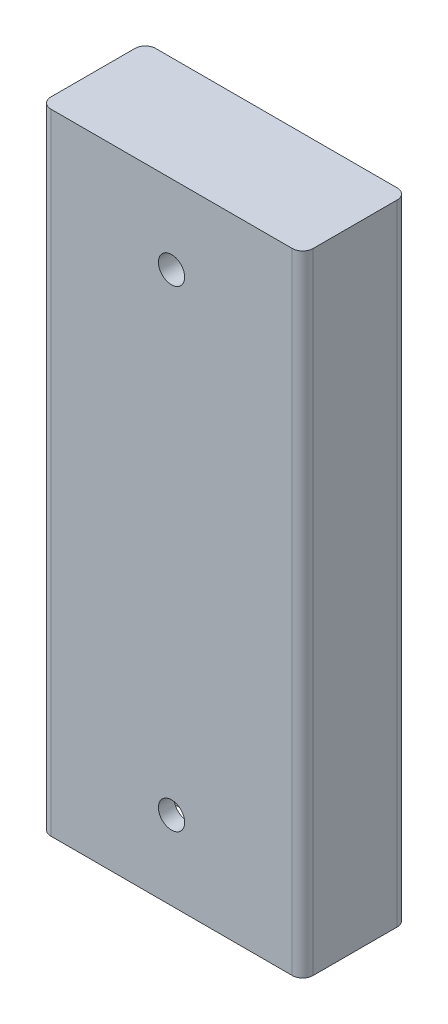
ISO-10303-21;
HEADER;
FILE_DESCRIPTION(('STEP AP214'),'2;1');
FILE_NAME('part.step','',(''),(''),'','','');
FILE_SCHEMA(('AUTOMOTIVE_DESIGN { 1 0 10303 214 1 1 1 1 }'));
ENDSEC;
DATA;
#1=APPLICATION_CONTEXT('core data for automotive mechanical design processes');
#2=APPLICATION_PROTOCOL_DEFINITION('international standard','automotive_design',2000,#1);
#3=PRODUCT_CONTEXT('',#1,'mechanical');
#4=PRODUCT('Part','Part','',(#3));
#5=PRODUCT_RELATED_PRODUCT_CATEGORY('part','',(#4));
#6=PRODUCT_DEFINITION_FORMATION('','',#4);
#7=PRODUCT_DEFINITION_CONTEXT('part definition',#1,'design');
#8=PRODUCT_DEFINITION('design','',#6,#7);
#9=PRODUCT_DEFINITION_SHAPE('','',#8);
#10=(LENGTH_UNIT() NAMED_UNIT(*) SI_UNIT(.MILLI.,.METRE.));
#11=(NAMED_UNIT(*) PLANE_ANGLE_UNIT() SI_UNIT($,.RADIAN.));
#12=(NAMED_UNIT(*) SI_UNIT($,.STERADIAN.) SOLID_ANGLE_UNIT());
#13=UNCERTAINTY_MEASURE_WITH_UNIT(LENGTH_MEASURE(1.E-05),#10,'distance_accuracy_value','');
#14=(GEOMETRIC_REPRESENTATION_CONTEXT(3) GLOBAL_UNCERTAINTY_ASSIGNED_CONTEXT((#13)) GLOBAL_UNIT_ASSIGNED_CONTEXT((#10,
#11,#12)) REPRESENTATION_CONTEXT('',''));
#15=CARTESIAN_POINT('',(0.,0.,0.));
#16=DIRECTION('',(0.,0.,1.));
#17=DIRECTION('',(1.,0.,0.));
#18=AXIS2_PLACEMENT_3D('',#15,#16,#17);
#19=CARTESIAN_POINT('',(2.,120.,-2.));
#20=DIRECTION('',(0.,-1.,0.));
#21=DIRECTION('',(0.,0.,-1.));
#22=AXIS2_PLACEMENT_3D('',#19,#20,#21);
#23=CYLINDRICAL_SURFACE('',#22,2.);
#24=CARTESIAN_POINT('',(2.,0.,-2.));
#25=DIRECTION('',(0.,1.,0.));
#26=DIRECTION('',(0.,0.,-1.));
#27=AXIS2_PLACEMENT_3D('',#24,#25,#26);
#28=CIRCLE('',#27,2.);
#29=CARTESIAN_POINT('',(0.,0.,-2.));
#30=VERTEX_POINT('',#29);
#31=CARTESIAN_POINT('',(2.,0.,0.));
#32=VERTEX_POINT('',#31);
#33=EDGE_CURVE('E158',#30,#32,#28,.T.);
#34=ORIENTED_EDGE('',*,*,#33,.T.);
#35=DIRECTION('',(0.,-1.,0.));
#36=VECTOR('',#35,1.);
#37=CARTESIAN_POINT('',(2.,120.,0.));
#38=LINE('',#37,#36);
#39=CARTESIAN_POINT('',(2.,120.,0.));
#40=VERTEX_POINT('',#39);
#41=EDGE_CURVE('E11',#40,#32,#38,.T.);
#42=ORIENTED_EDGE('',*,*,#41,.F.);
#43=CARTESIAN_POINT('',(2.,120.,-2.));
#44=DIRECTION('',(0.,1.,0.));
#45=DIRECTION('',(0.,0.,-1.));
#46=AXIS2_PLACEMENT_3D('',#43,#44,#45);
#47=CIRCLE('',#46,2.);
#48=CARTESIAN_POINT('',(0.,120.,-2.));
#49=VERTEX_POINT('',#48);
#50=EDGE_CURVE('E182',#49,#40,#47,.T.);
#51=ORIENTED_EDGE('',*,*,#50,.F.);
#52=DIRECTION('',(0.,-1.,0.));
#53=VECTOR('',#52,1.);
#54=CARTESIAN_POINT('',(0.,120.,-2.));
#55=LINE('',#54,#53);
#56=EDGE_CURVE('E154',#49,#30,#55,.T.);
#57=ORIENTED_EDGE('',*,*,#56,.T.);
#58=EDGE_LOOP('',(#34,#42,#51,#57));
#59=FACE_BOUND('',#58,.T.);
#60=ADVANCED_FACE('F43',(#59),#23,.T.);
#61=CARTESIAN_POINT('',(2.,120.,0.));
#62=DIRECTION('',(0.,0.,-1.));
#63=DIRECTION('',(-1.,0.,0.));
#64=AXIS2_PLACEMENT_3D('',#61,#62,#63);
#65=PLANE('',#64);
#66=CARTESIAN_POINT('',(25.,105.,0.));
#67=DIRECTION('',(0.,0.,1.));
#68=DIRECTION('',(1.,0.,0.));
#69=AXIS2_PLACEMENT_3D('',#66,#67,#68);
#70=CIRCLE('',#69,2.5);
#71=CARTESIAN_POINT('',(27.5,105.,0.));
#72=VERTEX_POINT('',#71);
#73=EDGE_CURVE('E203',#72,#72,#70,.T.);
#74=ORIENTED_EDGE('',*,*,#73,.F.);
#75=EDGE_LOOP('',(#74));
#76=FACE_BOUND('',#75,.T.);
#77=CARTESIAN_POINT('',(25.,15.,0.));
#78=DIRECTION('',(0.,0.,1.));
#79=DIRECTION('',(1.,0.,0.));
#80=AXIS2_PLACEMENT_3D('',#77,#78,#79);
#81=CIRCLE('',#80,2.5);
#82=CARTESIAN_POINT('',(27.5,15.,0.));
#83=VERTEX_POINT('',#82);
#84=EDGE_CURVE('E212',#83,#83,#81,.T.);
#85=ORIENTED_EDGE('',*,*,#84,.F.);
#86=EDGE_LOOP('',(#85));
#87=FACE_BOUND('',#86,.T.);
#88=DIRECTION('',(1.,0.,0.));
#89=VECTOR('',#88,1.);
#90=CARTESIAN_POINT('',(2.,0.,0.));
#91=LINE('',#90,#89);
#92=CARTESIAN_POINT('',(48.,0.,0.));
#93=VERTEX_POINT('',#92);
#94=EDGE_CURVE('E162',#32,#93,#91,.T.);
#95=ORIENTED_EDGE('',*,*,#94,.T.);
#96=DIRECTION('',(0.,-1.,0.));
#97=VECTOR('',#96,1.);
#98=CARTESIAN_POINT('',(48.,120.,0.));
#99=LINE('',#98,#97);
#100=CARTESIAN_POINT('',(48.,120.,0.));
#101=VERTEX_POINT('',#100);
#102=EDGE_CURVE('E52',#101,#93,#99,.T.);
#103=ORIENTED_EDGE('',*,*,#102,.F.);
#104=DIRECTION('',(1.,0.,0.));
#105=VECTOR('',#104,1.);
#106=CARTESIAN_POINT('',(2.,120.,0.));
#107=LINE('',#106,#105);
#108=EDGE_CURVE('E110',#40,#101,#107,.T.);
#109=ORIENTED_EDGE('',*,*,#108,.F.);
#110=ORIENTED_EDGE('',*,*,#41,.T.);
#111=EDGE_LOOP('',(#95,#103,#109,#110));
#112=FACE_BOUND('',#111,.T.);
#113=ADVANCED_FACE('F293',(#76,#87,#112),#65,.F.);
#114=CARTESIAN_POINT('',(48.,120.,-2.));
#115=DIRECTION('',(0.,-1.,0.));
#116=DIRECTION('',(0.,0.,-1.));
#117=AXIS2_PLACEMENT_3D('',#114,#115,#116);
#118=CYLINDRICAL_SURFACE('',#117,2.);
#119=CARTESIAN_POINT('',(48.,0.,-2.));
#120=DIRECTION('',(0.,1.,0.));
#121=DIRECTION('',(0.,0.,1.));
#122=AXIS2_PLACEMENT_3D('',#119,#120,#121);
#123=CIRCLE('',#122,2.);
#124=CARTESIAN_POINT('',(50.,0.,-2.));
#125=VERTEX_POINT('',#124);
#126=EDGE_CURVE('E166',#93,#125,#123,.T.);
#127=ORIENTED_EDGE('',*,*,#126,.T.);
#128=DIRECTION('',(0.,-1.,0.));
#129=VECTOR('',#128,1.);
#130=CARTESIAN_POINT('',(50.,120.,-2.));
#131=LINE('',#130,#129);
#132=CARTESIAN_POINT('',(50.,120.,-2.));
#133=VERTEX_POINT('',#132);
#134=EDGE_CURVE('E193',#133,#125,#131,.T.);
#135=ORIENTED_EDGE('',*,*,#134,.F.);
#136=CARTESIAN_POINT('',(48.,120.,-2.));
#137=DIRECTION('',(0.,1.,0.));
#138=DIRECTION('',(0.,0.,1.));
#139=AXIS2_PLACEMENT_3D('',#136,#137,#138);
#140=CIRCLE('',#139,2.);
#141=EDGE_CURVE('E270',#101,#133,#140,.T.);
#142=ORIENTED_EDGE('',*,*,#141,.F.);
#143=ORIENTED_EDGE('',*,*,#102,.T.);
#144=EDGE_LOOP('',(#127,#135,#142,#143));
#145=FACE_BOUND('',#144,.T.);
#146=ADVANCED_FACE('F298',(#145),#118,.T.);
#147=CARTESIAN_POINT('',(50.,120.,-2.));
#148=DIRECTION('',(-1.,0.,0.));
#149=DIRECTION('',(0.,0.,1.));
#150=AXIS2_PLACEMENT_3D('',#147,#148,#149);
#151=PLANE('',#150);
#152=DIRECTION('',(0.,0.,-1.));
#153=VECTOR('',#152,1.);
#154=CARTESIAN_POINT('',(50.,0.,-2.));
#155=LINE('',#154,#153);
#156=CARTESIAN_POINT('',(50.,0.,-18.));
#157=VERTEX_POINT('',#156);
#158=EDGE_CURVE('E169',#125,#157,#155,.T.);
#159=ORIENTED_EDGE('',*,*,#158,.T.);
#160=DIRECTION('',(0.,-1.,0.));
#161=VECTOR('',#160,1.);
#162=CARTESIAN_POINT('',(50.,120.,-18.));
#163=LINE('',#162,#161);
#164=CARTESIAN_POINT('',(50.,120.,-18.));
#165=VERTEX_POINT('',#164);
#166=EDGE_CURVE('E189',#165,#157,#163,.T.);
#167=ORIENTED_EDGE('',*,*,#166,.F.);
#168=DIRECTION('',(0.,0.,-1.));
#169=VECTOR('',#168,1.);
#170=CARTESIAN_POINT('',(50.,120.,-2.));
#171=LINE('',#170,#169);
#172=EDGE_CURVE('E273',#133,#165,#171,.T.);
#173=ORIENTED_EDGE('',*,*,#172,.F.);
#174=ORIENTED_EDGE('',*,*,#134,.T.);
#175=EDGE_LOOP('',(#159,#167,#173,#174));
#176=FACE_BOUND('',#175,.T.);
#177=ADVANCED_FACE('F313',(#176),#151,.F.);
#178=CARTESIAN_POINT('',(48.,120.,-18.));
#179=DIRECTION('',(0.,-1.,0.));
#180=DIRECTION('',(0.,0.,-1.));
#181=AXIS2_PLACEMENT_3D('',#178,#179,#180);
#182=CYLINDRICAL_SURFACE('',#181,2.);
#183=CARTESIAN_POINT('',(48.,0.,-18.));
#184=DIRECTION('',(0.,1.,0.));
#185=DIRECTION('',(0.,0.,-1.));
#186=AXIS2_PLACEMENT_3D('',#183,#184,#185);
#187=CIRCLE('',#186,2.);
#188=CARTESIAN_POINT('',(48.,0.,-20.));
#189=VERTEX_POINT('',#188);
#190=EDGE_CURVE('E172',#157,#189,#187,.T.);
#191=ORIENTED_EDGE('',*,*,#190,.T.);
#192=DIRECTION('',(0.,-1.,0.));
#193=VECTOR('',#192,1.);
#194=CARTESIAN_POINT('',(48.,120.,-20.));
#195=LINE('',#194,#193);
#196=CARTESIAN_POINT('',(48.,120.,-20.));
#197=VERTEX_POINT('',#196);
#198=EDGE_CURVE('E147',#197,#189,#195,.T.);
#199=ORIENTED_EDGE('',*,*,#198,.F.);
#200=CARTESIAN_POINT('',(48.,120.,-18.));
#201=DIRECTION('',(0.,1.,0.));
#202=DIRECTION('',(0.,0.,-1.));
#203=AXIS2_PLACEMENT_3D('',#200,#201,#202);
#204=CIRCLE('',#203,2.);
#205=EDGE_CURVE('E133',#165,#197,#204,.T.);
#206=ORIENTED_EDGE('',*,*,#205,.F.);
#207=ORIENTED_EDGE('',*,*,#166,.T.);
#208=EDGE_LOOP('',(#191,#199,#206,#207));
#209=FACE_BOUND('',#208,.T.);
#210=ADVANCED_FACE('F316',(#209),#182,.T.);
#211=CARTESIAN_POINT('',(2.,120.,-20.));
#212=DIRECTION('',(0.,0.,1.));
#213=DIRECTION('',(1.,0.,0.));
#214=AXIS2_PLACEMENT_3D('',#211,#212,#213);
#215=PLANE('',#214);
#216=CARTESIAN_POINT('',(25.,105.,-20.));
#217=DIRECTION('',(0.,0.,1.));
#218=DIRECTION('',(1.,0.,0.));
#219=AXIS2_PLACEMENT_3D('',#216,#217,#218);
#220=CIRCLE('',#219,2.5);
#221=CARTESIAN_POINT('',(27.5,105.,-20.));
#222=VERTEX_POINT('',#221);
#223=EDGE_CURVE('E46',#222,#222,#220,.T.);
#224=ORIENTED_EDGE('',*,*,#223,.T.);
#225=EDGE_LOOP('',(#224));
#226=FACE_BOUND('',#225,.T.);
#227=CARTESIAN_POINT('',(25.,15.,-20.));
#228=DIRECTION('',(0.,0.,1.));
#229=DIRECTION('',(1.,0.,0.));
#230=AXIS2_PLACEMENT_3D('',#227,#228,#229);
#231=CIRCLE('',#230,2.5);
#232=CARTESIAN_POINT('',(27.5,15.,-20.));
#233=VERTEX_POINT('',#232);
#234=EDGE_CURVE('E209',#233,#233,#231,.T.);
#235=ORIENTED_EDGE('',*,*,#234,.T.);
#236=EDGE_LOOP('',(#235));
#237=FACE_BOUND('',#236,.T.);
#238=DIRECTION('',(-1.,0.,0.));
#239=VECTOR('',#238,1.);
#240=CARTESIAN_POINT('',(2.,0.,-20.));
#241=LINE('',#240,#239);
#242=CARTESIAN_POINT('',(2.,0.,-20.));
#243=VERTEX_POINT('',#242);
#244=EDGE_CURVE('E143',#189,#243,#241,.T.);
#245=ORIENTED_EDGE('',*,*,#244,.T.);
#246=DIRECTION('',(0.,-1.,0.));
#247=VECTOR('',#246,1.);
#248=CARTESIAN_POINT('',(2.,120.,-20.));
#249=LINE('',#248,#247);
#250=CARTESIAN_POINT('',(2.,120.,-20.));
#251=VERTEX_POINT('',#250);
#252=EDGE_CURVE('E140',#251,#243,#249,.T.);
#253=ORIENTED_EDGE('',*,*,#252,.F.);
#254=DIRECTION('',(-1.,0.,0.));
#255=VECTOR('',#254,1.);
#256=CARTESIAN_POINT('',(2.,120.,-20.));
#257=LINE('',#256,#255);
#258=EDGE_CURVE('E126',#197,#251,#257,.T.);
#259=ORIENTED_EDGE('',*,*,#258,.F.);
#260=ORIENTED_EDGE('',*,*,#198,.T.);
#261=EDGE_LOOP('',(#245,#253,#259,#260));
#262=FACE_BOUND('',#261,.T.);
#263=ADVANCED_FACE('F141',(#226,#237,#262),#215,.F.);
#264=CARTESIAN_POINT('',(2.,120.,-18.));
#265=DIRECTION('',(0.,-1.,0.));
#266=DIRECTION('',(0.,0.,-1.));
#267=AXIS2_PLACEMENT_3D('',#264,#265,#266);
#268=CYLINDRICAL_SURFACE('',#267,2.);
#269=CARTESIAN_POINT('',(2.,0.,-18.));
#270=DIRECTION('',(0.,1.,0.));
#271=DIRECTION('',(0.,0.,-1.));
#272=AXIS2_PLACEMENT_3D('',#269,#270,#271);
#273=CIRCLE('',#272,2.);
#274=CARTESIAN_POINT('',(0.,0.,-18.));
#275=VERTEX_POINT('',#274);
#276=EDGE_CURVE('E177',#243,#275,#273,.T.);
#277=ORIENTED_EDGE('',*,*,#276,.T.);
#278=DIRECTION('',(0.,-1.,0.));
#279=VECTOR('',#278,1.);
#280=CARTESIAN_POINT('',(0.,120.,-18.));
#281=LINE('',#280,#279);
#282=CARTESIAN_POINT('',(0.,120.,-18.));
#283=VERTEX_POINT('',#282);
#284=EDGE_CURVE('E148',#283,#275,#281,.T.);
#285=ORIENTED_EDGE('',*,*,#284,.F.);
#286=CARTESIAN_POINT('',(2.,120.,-18.));
#287=DIRECTION('',(0.,1.,0.));
#288=DIRECTION('',(0.,0.,-1.));
#289=AXIS2_PLACEMENT_3D('',#286,#287,#288);
#290=CIRCLE('',#289,2.);
#291=EDGE_CURVE('E130',#251,#283,#290,.T.);
#292=ORIENTED_EDGE('',*,*,#291,.F.);
#293=ORIENTED_EDGE('',*,*,#252,.T.);
#294=EDGE_LOOP('',(#277,#285,#292,#293));
#295=FACE_BOUND('',#294,.T.);
#296=ADVANCED_FACE('F150',(#295),#268,.T.);
#297=CARTESIAN_POINT('',(0.,120.,-2.));
#298=DIRECTION('',(1.,0.,0.));
#299=DIRECTION('',(0.,0.,-1.));
#300=AXIS2_PLACEMENT_3D('',#297,#298,#299);
#301=PLANE('',#300);
#302=DIRECTION('',(0.,0.,1.));
#303=VECTOR('',#302,1.);
#304=CARTESIAN_POINT('',(0.,0.,-2.));
#305=LINE('',#304,#303);
#306=EDGE_CURVE('E102',#275,#30,#305,.T.);
#307=ORIENTED_EDGE('',*,*,#306,.T.);
#308=ORIENTED_EDGE('',*,*,#56,.F.);
#309=DIRECTION('',(0.,0.,1.));
#310=VECTOR('',#309,1.);
#311=CARTESIAN_POINT('',(0.,120.,-2.));
#312=LINE('',#311,#310);
#313=EDGE_CURVE('E69',#283,#49,#312,.T.);
#314=ORIENTED_EDGE('',*,*,#313,.F.);
#315=ORIENTED_EDGE('',*,*,#284,.T.);
#316=EDGE_LOOP('',(#307,#308,#314,#315));
#317=FACE_BOUND('',#316,.T.);
#318=ADVANCED_FACE('F317',(#317),#301,.F.);
#319=CARTESIAN_POINT('',(2.,120.,-2.));
#320=DIRECTION('',(0.,-1.,0.));
#321=DIRECTION('',(0.,0.,-1.));
#322=AXIS2_PLACEMENT_3D('',#319,#320,#321);
#323=PLANE('',#322);
#324=ORIENTED_EDGE('',*,*,#50,.T.);
#325=ORIENTED_EDGE('',*,*,#108,.T.);
#326=ORIENTED_EDGE('',*,*,#141,.T.);
#327=ORIENTED_EDGE('',*,*,#172,.T.);
#328=ORIENTED_EDGE('',*,*,#205,.T.);
#329=ORIENTED_EDGE('',*,*,#258,.T.);
#330=ORIENTED_EDGE('',*,*,#291,.T.);
#331=ORIENTED_EDGE('',*,*,#313,.T.);
#332=EDGE_LOOP('',(#324,#325,#326,#327,#328,#329,#330,#331));
#333=FACE_BOUND('',#332,.T.);
#334=ADVANCED_FACE('F128',(#333),#323,.F.);
#335=CARTESIAN_POINT('',(2.,0.,-2.));
#336=DIRECTION('',(0.,-1.,0.));
#337=DIRECTION('',(0.,0.,-1.));
#338=AXIS2_PLACEMENT_3D('',#335,#336,#337);
#339=PLANE('',#338);
#340=DIRECTION('',(-1.,0.,0.));
#341=VECTOR('',#340,1.);
#342=CARTESIAN_POINT('',(47.,0.,-3.));
#343=LINE('',#342,#341);
#344=CARTESIAN_POINT('',(47.,0.,-3.));
#345=VERTEX_POINT('',#344);
#346=CARTESIAN_POINT('',(3.,0.,-3.));
#347=VERTEX_POINT('',#346);
#348=EDGE_CURVE('E60',#345,#347,#343,.T.);
#349=ORIENTED_EDGE('',*,*,#348,.F.);
#350=DIRECTION('',(0.,0.,1.));
#351=VECTOR('',#350,1.);
#352=CARTESIAN_POINT('',(47.,0.,-17.));
#353=LINE('',#352,#351);
#354=CARTESIAN_POINT('',(47.,0.,-17.));
#355=VERTEX_POINT('',#354);
#356=EDGE_CURVE('E228',#355,#345,#353,.T.);
#357=ORIENTED_EDGE('',*,*,#356,.F.);
#358=DIRECTION('',(1.,0.,0.));
#359=VECTOR('',#358,1.);
#360=CARTESIAN_POINT('',(3.,0.,-17.));
#361=LINE('',#360,#359);
#362=CARTESIAN_POINT('',(3.,0.,-17.));
#363=VERTEX_POINT('',#362);
#364=EDGE_CURVE('E247',#363,#355,#361,.T.);
#365=ORIENTED_EDGE('',*,*,#364,.F.);
#366=DIRECTION('',(0.,0.,-1.));
#367=VECTOR('',#366,1.);
#368=CARTESIAN_POINT('',(3.,0.,-3.));
#369=LINE('',#368,#367);
#370=EDGE_CURVE('E243',#347,#363,#369,.T.);
#371=ORIENTED_EDGE('',*,*,#370,.F.);
#372=EDGE_LOOP('',(#349,#357,#365,#371));
#373=FACE_BOUND('',#372,.T.);
#374=ORIENTED_EDGE('',*,*,#33,.F.);
#375=ORIENTED_EDGE('',*,*,#306,.F.);
#376=ORIENTED_EDGE('',*,*,#276,.F.);
#377=ORIENTED_EDGE('',*,*,#244,.F.);
#378=ORIENTED_EDGE('',*,*,#190,.F.);
#379=ORIENTED_EDGE('',*,*,#158,.F.);
#380=ORIENTED_EDGE('',*,*,#126,.F.);
#381=ORIENTED_EDGE('',*,*,#94,.F.);
#382=EDGE_LOOP('',(#374,#375,#376,#377,#378,#379,#380,#381));
#383=FACE_BOUND('',#382,.T.);
#384=ADVANCED_FACE('F304',(#373,#383),#339,.T.);
#385=CARTESIAN_POINT('',(47.,30.,-3.));
#386=DIRECTION('',(0.,0.,1.));
#387=DIRECTION('',(1.,0.,0.));
#388=AXIS2_PLACEMENT_3D('',#385,#386,#387);
#389=PLANE('',#388);
#390=CARTESIAN_POINT('',(25.,15.,-3.));
#391=DIRECTION('',(0.,0.,1.));
#392=DIRECTION('',(1.,0.,0.));
#393=AXIS2_PLACEMENT_3D('',#390,#391,#392);
#394=CIRCLE('',#393,2.5);
#395=CARTESIAN_POINT('',(27.5,15.,-3.));
#396=VERTEX_POINT('',#395);
#397=EDGE_CURVE('E202',#396,#396,#394,.T.);
#398=ORIENTED_EDGE('',*,*,#397,.T.);
#399=EDGE_LOOP('',(#398));
#400=FACE_BOUND('',#399,.T.);
#401=ORIENTED_EDGE('',*,*,#348,.T.);
#402=DIRECTION('',(0.,-1.,0.));
#403=VECTOR('',#402,1.);
#404=CARTESIAN_POINT('',(3.,30.,-3.));
#405=LINE('',#404,#403);
#406=CARTESIAN_POINT('',(3.,30.,-3.));
#407=VERTEX_POINT('',#406);
#408=EDGE_CURVE('E240',#407,#347,#405,.T.);
#409=ORIENTED_EDGE('',*,*,#408,.F.);
#410=DIRECTION('',(-1.,0.,0.));
#411=VECTOR('',#410,1.);
#412=CARTESIAN_POINT('',(47.,30.,-3.));
#413=LINE('',#412,#411);
#414=CARTESIAN_POINT('',(47.,30.,-3.));
#415=VERTEX_POINT('',#414);
#416=EDGE_CURVE('E223',#415,#407,#413,.T.);
#417=ORIENTED_EDGE('',*,*,#416,.F.);
#418=DIRECTION('',(0.,-1.,0.));
#419=VECTOR('',#418,1.);
#420=CARTESIAN_POINT('',(47.,30.,-3.));
#421=LINE('',#420,#419);
#422=EDGE_CURVE('E163',#415,#345,#421,.T.);
#423=ORIENTED_EDGE('',*,*,#422,.T.);
#424=EDGE_LOOP('',(#401,#409,#417,#423));
#425=FACE_BOUND('',#424,.T.);
#426=ADVANCED_FACE('F378',(#400,#425),#389,.F.);
#427=CARTESIAN_POINT('',(47.,30.,-17.));
#428=DIRECTION('',(1.,0.,0.));
#429=DIRECTION('',(0.,0.,-1.));
#430=AXIS2_PLACEMENT_3D('',#427,#428,#429);
#431=PLANE('',#430);
#432=ORIENTED_EDGE('',*,*,#356,.T.);
#433=ORIENTED_EDGE('',*,*,#422,.F.);
#434=DIRECTION('',(0.,0.,1.));
#435=VECTOR('',#434,1.);
#436=CARTESIAN_POINT('',(47.,30.,-17.));
#437=LINE('',#436,#435);
#438=CARTESIAN_POINT('',(47.,30.,-17.));
#439=VERTEX_POINT('',#438);
#440=EDGE_CURVE('E236',#439,#415,#437,.T.);
#441=ORIENTED_EDGE('',*,*,#440,.F.);
#442=DIRECTION('',(0.,-1.,0.));
#443=VECTOR('',#442,1.);
#444=CARTESIAN_POINT('',(47.,30.,-17.));
#445=LINE('',#444,#443);
#446=EDGE_CURVE('E256',#439,#355,#445,.T.);
#447=ORIENTED_EDGE('',*,*,#446,.T.);
#448=EDGE_LOOP('',(#432,#433,#441,#447));
#449=FACE_BOUND('',#448,.T.);
#450=ADVANCED_FACE('F386',(#449),#431,.F.);
#451=CARTESIAN_POINT('',(3.,30.,-17.));
#452=DIRECTION('',(0.,0.,-1.));
#453=DIRECTION('',(-1.,0.,0.));
#454=AXIS2_PLACEMENT_3D('',#451,#452,#453);
#455=PLANE('',#454);
#456=CARTESIAN_POINT('',(25.,15.,-17.));
#457=DIRECTION('',(0.,0.,-1.));
#458=DIRECTION('',(-1.,0.,0.));
#459=AXIS2_PLACEMENT_3D('',#456,#457,#458);
#460=CIRCLE('',#459,2.5);
#461=CARTESIAN_POINT('',(22.5,15.,-17.));
#462=VERTEX_POINT('',#461);
#463=EDGE_CURVE('E199',#462,#462,#460,.T.);
#464=ORIENTED_EDGE('',*,*,#463,.T.);
#465=EDGE_LOOP('',(#464));
#466=FACE_BOUND('',#465,.T.);
#467=ORIENTED_EDGE('',*,*,#364,.T.);
#468=ORIENTED_EDGE('',*,*,#446,.F.);
#469=DIRECTION('',(1.,0.,0.));
#470=VECTOR('',#469,1.);
#471=CARTESIAN_POINT('',(3.,30.,-17.));
#472=LINE('',#471,#470);
#473=CARTESIAN_POINT('',(3.,30.,-17.));
#474=VERTEX_POINT('',#473);
#475=EDGE_CURVE('E232',#474,#439,#472,.T.);
#476=ORIENTED_EDGE('',*,*,#475,.F.);
#477=DIRECTION('',(0.,-1.,0.));
#478=VECTOR('',#477,1.);
#479=CARTESIAN_POINT('',(3.,30.,-17.));
#480=LINE('',#479,#478);
#481=EDGE_CURVE('E260',#474,#363,#480,.T.);
#482=ORIENTED_EDGE('',*,*,#481,.T.);
#483=EDGE_LOOP('',(#467,#468,#476,#482));
#484=FACE_BOUND('',#483,.T.);
#485=ADVANCED_FACE('F391',(#466,#484),#455,.F.);
#486=CARTESIAN_POINT('',(3.,30.,-3.));
#487=DIRECTION('',(-1.,0.,0.));
#488=DIRECTION('',(0.,0.,1.));
#489=AXIS2_PLACEMENT_3D('',#486,#487,#488);
#490=PLANE('',#489);
#491=ORIENTED_EDGE('',*,*,#370,.T.);
#492=ORIENTED_EDGE('',*,*,#481,.F.);
#493=DIRECTION('',(0.,0.,-1.));
#494=VECTOR('',#493,1.);
#495=CARTESIAN_POINT('',(3.,30.,-3.));
#496=LINE('',#495,#494);
#497=EDGE_CURVE('E227',#407,#474,#496,.T.);
#498=ORIENTED_EDGE('',*,*,#497,.F.);
#499=ORIENTED_EDGE('',*,*,#408,.T.);
#500=EDGE_LOOP('',(#491,#492,#498,#499));
#501=FACE_BOUND('',#500,.T.);
#502=ADVANCED_FACE('F400',(#501),#490,.F.);
#503=CARTESIAN_POINT('',(0.,30.,0.));
#504=DIRECTION('',(0.,-1.,0.));
#505=DIRECTION('',(0.,0.,-1.));
#506=AXIS2_PLACEMENT_3D('',#503,#504,#505);
#507=PLANE('',#506);
#508=ORIENTED_EDGE('',*,*,#416,.T.);
#509=ORIENTED_EDGE('',*,*,#497,.T.);
#510=ORIENTED_EDGE('',*,*,#475,.T.);
#511=ORIENTED_EDGE('',*,*,#440,.T.);
#512=EDGE_LOOP('',(#508,#509,#510,#511));
#513=FACE_BOUND('',#512,.T.);
#514=ADVANCED_FACE('F405',(#513),#507,.T.);
#515=CARTESIAN_POINT('',(25.,15.,-30.));
#516=DIRECTION('',(0.,0.,1.));
#517=DIRECTION('',(1.,0.,0.));
#518=AXIS2_PLACEMENT_3D('',#515,#516,#517);
#519=CYLINDRICAL_SURFACE('',#518,2.5);
#520=ORIENTED_EDGE('',*,*,#463,.F.);
#521=EDGE_LOOP('',(#520));
#522=FACE_BOUND('',#521,.T.);
#523=ORIENTED_EDGE('',*,*,#234,.F.);
#524=EDGE_LOOP('',(#523));
#525=FACE_BOUND('',#524,.T.);
#526=ADVANCED_FACE('F289',(#522,#525),#519,.F.);
#527=ORIENTED_EDGE('',*,*,#84,.T.);
#528=EDGE_LOOP('',(#527));
#529=FACE_BOUND('',#528,.T.);
#530=ORIENTED_EDGE('',*,*,#397,.F.);
#531=EDGE_LOOP('',(#530));
#532=FACE_BOUND('',#531,.T.);
#533=ADVANCED_FACE('F284',(#529,#532),#519,.F.);
#534=CARTESIAN_POINT('',(25.,105.,-30.));
#535=DIRECTION('',(0.,0.,1.));
#536=DIRECTION('',(1.,0.,0.));
#537=AXIS2_PLACEMENT_3D('',#534,#535,#536);
#538=CYLINDRICAL_SURFACE('',#537,2.5);
#539=ORIENTED_EDGE('',*,*,#73,.T.);
#540=EDGE_LOOP('',(#539));
#541=FACE_BOUND('',#540,.T.);
#542=ORIENTED_EDGE('',*,*,#223,.F.);
#543=EDGE_LOOP('',(#542));
#544=FACE_BOUND('',#543,.T.);
#545=ADVANCED_FACE('F282',(#541,#544),#538,.F.);
#546=CLOSED_SHELL('',(#60,#113,#146,#177,#210,#263,#296,#318,#334,#384,#426,#450,#485,#502,#514,
#526,#533,#545));
#547=MANIFOLD_SOLID_BREP('B2',#546);
#548=ADVANCED_BREP_SHAPE_REPRESENTATION('',(#18,#547),#14);
#549=SHAPE_DEFINITION_REPRESENTATION(#9,#548);
ENDSEC;
END-ISO-10303-21;
